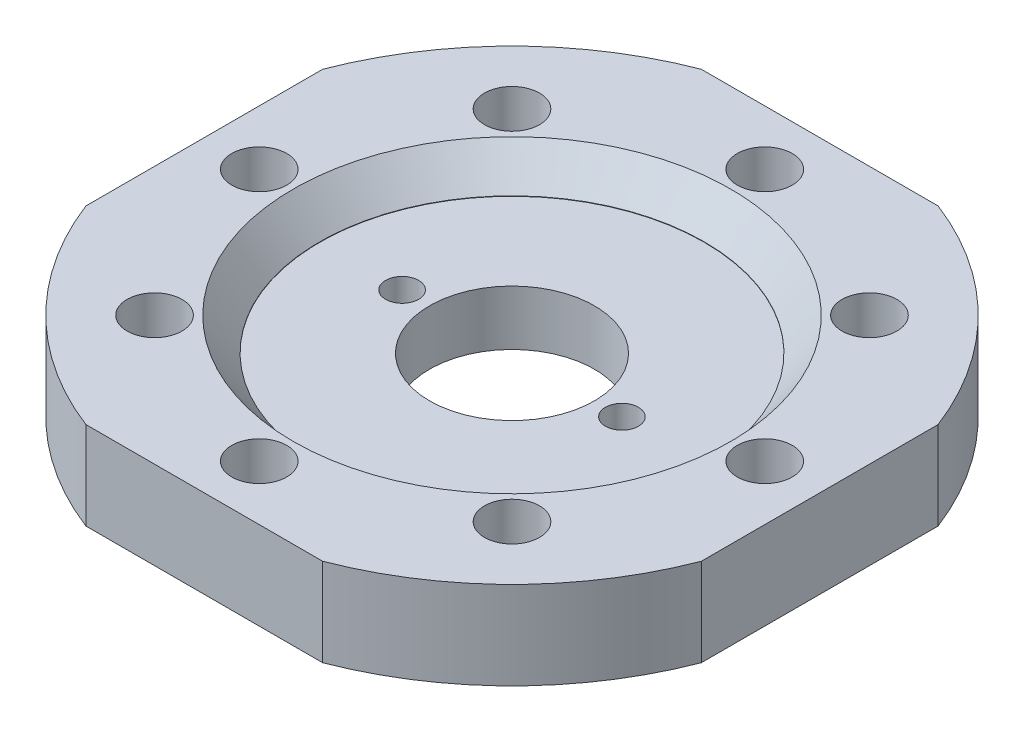
ISO-10303-21;
HEADER;
FILE_DESCRIPTION(('STEP AP214'),'2;1');
FILE_NAME('part.step','',(''),(''),'','','');
FILE_SCHEMA(('AUTOMOTIVE_DESIGN { 1 0 10303 214 1 1 1 1 }'));
ENDSEC;
DATA;
#1=APPLICATION_CONTEXT('core data for automotive mechanical design processes');
#2=APPLICATION_PROTOCOL_DEFINITION('international standard','automotive_design',2000,#1);
#3=PRODUCT_CONTEXT('',#1,'mechanical');
#4=PRODUCT('Part','Part','',(#3));
#5=PRODUCT_RELATED_PRODUCT_CATEGORY('part','',(#4));
#6=PRODUCT_DEFINITION_FORMATION('','',#4);
#7=PRODUCT_DEFINITION_CONTEXT('part definition',#1,'design');
#8=PRODUCT_DEFINITION('design','',#6,#7);
#9=PRODUCT_DEFINITION_SHAPE('','',#8);
#10=(LENGTH_UNIT() NAMED_UNIT(*) SI_UNIT(.MILLI.,.METRE.));
#11=(NAMED_UNIT(*) PLANE_ANGLE_UNIT() SI_UNIT($,.RADIAN.));
#12=(NAMED_UNIT(*) SI_UNIT($,.STERADIAN.) SOLID_ANGLE_UNIT());
#13=UNCERTAINTY_MEASURE_WITH_UNIT(LENGTH_MEASURE(1.E-05),#10,'distance_accuracy_value','');
#14=(GEOMETRIC_REPRESENTATION_CONTEXT(3) GLOBAL_UNCERTAINTY_ASSIGNED_CONTEXT((#13)) GLOBAL_UNIT_ASSIGNED_CONTEXT((#10,
#11,#12)) REPRESENTATION_CONTEXT('',''));
#15=CARTESIAN_POINT('',(0.,0.,0.));
#16=DIRECTION('',(0.,0.,1.));
#17=DIRECTION('',(1.,0.,0.));
#18=AXIS2_PLACEMENT_3D('',#15,#16,#17);
#19=CARTESIAN_POINT('',(0.,40.,0.));
#20=DIRECTION('',(0.,-1.,0.));
#21=DIRECTION('',(0.,0.,-1.));
#22=AXIS2_PLACEMENT_3D('',#19,#20,#21);
#23=CYLINDRICAL_SURFACE('',#22,150.);
#24=CARTESIAN_POINT('',(0.,40.,0.));
#25=DIRECTION('',(0.,1.,0.));
#26=DIRECTION('',(0.,0.,1.));
#27=AXIS2_PLACEMENT_3D('',#24,#25,#26);
#28=CIRCLE('',#27,150.);
#29=CARTESIAN_POINT('',(-53.8516480713449,40.,-140.));
#30=VERTEX_POINT('',#29);
#31=CARTESIAN_POINT('',(-140.,40.,-53.8516480713449));
#32=VERTEX_POINT('',#31);
#33=EDGE_CURVE('E274',#30,#32,#28,.T.);
#34=ORIENTED_EDGE('',*,*,#33,.F.);
#35=DIRECTION('',(0.,-1.,0.));
#36=VECTOR('',#35,1.);
#37=CARTESIAN_POINT('',(-53.8516480713449,40.,-140.));
#38=LINE('',#37,#36);
#39=CARTESIAN_POINT('',(-53.8516480713449,0.,-140.));
#40=VERTEX_POINT('',#39);
#41=EDGE_CURVE('E151',#30,#40,#38,.T.);
#42=ORIENTED_EDGE('',*,*,#41,.T.);
#43=CARTESIAN_POINT('',(0.,0.,0.));
#44=DIRECTION('',(0.,1.,0.));
#45=DIRECTION('',(0.,0.,1.));
#46=AXIS2_PLACEMENT_3D('',#43,#44,#45);
#47=CIRCLE('',#46,150.);
#48=CARTESIAN_POINT('',(-140.,0.,-53.8516480713449));
#49=VERTEX_POINT('',#48);
#50=EDGE_CURVE('E267',#40,#49,#47,.T.);
#51=ORIENTED_EDGE('',*,*,#50,.T.);
#52=DIRECTION('',(0.,-1.,0.));
#53=VECTOR('',#52,1.);
#54=CARTESIAN_POINT('',(-140.,40.,-53.8516480713449));
#55=LINE('',#54,#53);
#56=EDGE_CURVE('E179',#49,#32,#55,.F.);
#57=ORIENTED_EDGE('',*,*,#56,.T.);
#58=EDGE_LOOP('',(#34,#42,#51,#57));
#59=FACE_BOUND('',#58,.T.);
#60=ADVANCED_FACE('F51',(#59),#23,.T.);
#61=DIRECTION('',(0.,-1.,0.));
#62=VECTOR('',#61,1.);
#63=CARTESIAN_POINT('',(140.,40.,53.8516480713449));
#64=LINE('',#63,#62);
#65=CARTESIAN_POINT('',(140.,40.,53.8516480713449));
#66=VERTEX_POINT('',#65);
#67=CARTESIAN_POINT('',(140.,0.,53.8516480713449));
#68=VERTEX_POINT('',#67);
#69=EDGE_CURVE('E162',#66,#68,#64,.T.);
#70=ORIENTED_EDGE('',*,*,#69,.F.);
#71=CARTESIAN_POINT('',(53.8516480713449,40.,140.));
#72=VERTEX_POINT('',#71);
#73=EDGE_CURVE('E273',#72,#66,#28,.T.);
#74=ORIENTED_EDGE('',*,*,#73,.F.);
#75=DIRECTION('',(0.,-1.,0.));
#76=VECTOR('',#75,1.);
#77=CARTESIAN_POINT('',(53.8516480713449,40.,140.));
#78=LINE('',#77,#76);
#79=CARTESIAN_POINT('',(53.8516480713449,0.,140.));
#80=VERTEX_POINT('',#79);
#81=EDGE_CURVE('E168',#80,#72,#78,.F.);
#82=ORIENTED_EDGE('',*,*,#81,.F.);
#83=EDGE_CURVE('E279',#80,#68,#47,.T.);
#84=ORIENTED_EDGE('',*,*,#83,.T.);
#85=EDGE_LOOP('',(#70,#74,#82,#84));
#86=FACE_BOUND('',#85,.T.);
#87=ADVANCED_FACE('F309',(#86),#23,.T.);
#88=CARTESIAN_POINT('',(140.,0.,-53.8516480713449));
#89=VERTEX_POINT('',#88);
#90=CARTESIAN_POINT('',(53.8516480713449,0.,-140.));
#91=VERTEX_POINT('',#90);
#92=EDGE_CURVE('E307',#89,#91,#47,.T.);
#93=ORIENTED_EDGE('',*,*,#92,.T.);
#94=DIRECTION('',(0.,-1.,0.));
#95=VECTOR('',#94,1.);
#96=CARTESIAN_POINT('',(53.8516480713449,40.,-140.));
#97=LINE('',#96,#95);
#98=CARTESIAN_POINT('',(53.8516480713449,40.,-140.));
#99=VERTEX_POINT('',#98);
#100=EDGE_CURVE('E67',#91,#99,#97,.F.);
#101=ORIENTED_EDGE('',*,*,#100,.T.);
#102=CARTESIAN_POINT('',(140.,40.,-53.8516480713449));
#103=VERTEX_POINT('',#102);
#104=EDGE_CURVE('E338',#103,#99,#28,.T.);
#105=ORIENTED_EDGE('',*,*,#104,.F.);
#106=DIRECTION('',(0.,-1.,0.));
#107=VECTOR('',#106,1.);
#108=CARTESIAN_POINT('',(140.,40.,-53.8516480713449));
#109=LINE('',#108,#107);
#110=EDGE_CURVE('E158',#89,#103,#109,.F.);
#111=ORIENTED_EDGE('',*,*,#110,.F.);
#112=EDGE_LOOP('',(#93,#101,#105,#111));
#113=FACE_BOUND('',#112,.T.);
#114=ADVANCED_FACE('F348',(#113),#23,.T.);
#115=CARTESIAN_POINT('',(0.,40.,0.));
#116=DIRECTION('',(0.,1.,0.));
#117=DIRECTION('',(0.,0.,1.));
#118=AXIS2_PLACEMENT_3D('',#115,#116,#117);
#119=PLANE('',#118);
#120=DIRECTION('',(1.,0.,0.));
#121=VECTOR('',#120,1.);
#122=CARTESIAN_POINT('',(0.,40.,-140.));
#123=LINE('',#122,#121);
#124=EDGE_CURVE('E155',#30,#99,#123,.T.);
#125=ORIENTED_EDGE('',*,*,#124,.F.);
#126=ORIENTED_EDGE('',*,*,#33,.T.);
#127=DIRECTION('',(0.,0.,-1.));
#128=VECTOR('',#127,1.);
#129=CARTESIAN_POINT('',(-140.,40.,0.));
#130=LINE('',#129,#128);
#131=CARTESIAN_POINT('',(-140.,40.,53.8516480713449));
#132=VERTEX_POINT('',#131);
#133=EDGE_CURVE('E187',#132,#32,#130,.T.);
#134=ORIENTED_EDGE('',*,*,#133,.F.);
#135=CARTESIAN_POINT('',(-53.8516480713449,40.,140.));
#136=VERTEX_POINT('',#135);
#137=EDGE_CURVE('E268',#132,#136,#28,.T.);
#138=ORIENTED_EDGE('',*,*,#137,.T.);
#139=DIRECTION('',(1.,0.,0.));
#140=VECTOR('',#139,1.);
#141=CARTESIAN_POINT('',(0.,40.,140.));
#142=LINE('',#141,#140);
#143=EDGE_CURVE('E176',#136,#72,#142,.T.);
#144=ORIENTED_EDGE('',*,*,#143,.T.);
#145=ORIENTED_EDGE('',*,*,#73,.T.);
#146=DIRECTION('',(0.,0.,-1.));
#147=VECTOR('',#146,1.);
#148=CARTESIAN_POINT('',(140.,40.,0.));
#149=LINE('',#148,#147);
#150=EDGE_CURVE('E74',#66,#103,#149,.T.);
#151=ORIENTED_EDGE('',*,*,#150,.T.);
#152=ORIENTED_EDGE('',*,*,#104,.T.);
#153=EDGE_LOOP('',(#125,#126,#134,#138,#144,#145,#151,#152));
#154=FACE_BOUND('',#153,.T.);
#155=CARTESIAN_POINT('',(0.,40.,0.));
#156=DIRECTION('',(0.,1.,0.));
#157=DIRECTION('',(0.,0.,1.));
#158=AXIS2_PLACEMENT_3D('',#155,#156,#157);
#159=CIRCLE('',#158,99.5);
#160=CARTESIAN_POINT('',(0.,40.,99.5));
#161=VERTEX_POINT('',#160);
#162=EDGE_CURVE('E283',#161,#161,#159,.F.);
#163=ORIENTED_EDGE('',*,*,#162,.T.);
#164=EDGE_LOOP('',(#163));
#165=FACE_BOUND('',#164,.T.);
#166=CARTESIAN_POINT('',(81.3172798364539,40.,81.317279836452));
#167=DIRECTION('',(0.,1.,0.));
#168=DIRECTION('',(0.,0.,1.));
#169=AXIS2_PLACEMENT_3D('',#166,#167,#168);
#170=CIRCLE('',#169,12.5);
#171=CARTESIAN_POINT('',(81.3172798364539,40.,93.817279836452));
#172=VERTEX_POINT('',#171);
#173=EDGE_CURVE('E191',#172,#172,#170,.T.);
#174=ORIENTED_EDGE('',*,*,#173,.F.);
#175=EDGE_LOOP('',(#174));
#176=FACE_BOUND('',#175,.T.);
#177=CARTESIAN_POINT('',(1.20456106190088E-12,40.,115.));
#178=DIRECTION('',(0.,1.,0.));
#179=DIRECTION('',(0.,0.,1.));
#180=AXIS2_PLACEMENT_3D('',#177,#178,#179);
#181=CIRCLE('',#180,12.5);
#182=CARTESIAN_POINT('',(1.20456106190088E-12,40.,127.5));
#183=VERTEX_POINT('',#182);
#184=EDGE_CURVE('E199',#183,#183,#181,.T.);
#185=ORIENTED_EDGE('',*,*,#184,.F.);
#186=EDGE_LOOP('',(#185));
#187=FACE_BOUND('',#186,.T.);
#188=CARTESIAN_POINT('',(-81.3172798364523,40.,81.3172798364537));
#189=DIRECTION('',(0.,1.,0.));
#190=DIRECTION('',(0.,0.,1.));
#191=AXIS2_PLACEMENT_3D('',#188,#189,#190);
#192=CIRCLE('',#191,12.5);
#193=CARTESIAN_POINT('',(-81.3172798364523,40.,93.8172798364537));
#194=VERTEX_POINT('',#193);
#195=EDGE_CURVE('E207',#194,#194,#192,.T.);
#196=ORIENTED_EDGE('',*,*,#195,.F.);
#197=EDGE_LOOP('',(#196));
#198=FACE_BOUND('',#197,.T.);
#199=CARTESIAN_POINT('',(-115.,40.,0.));
#200=DIRECTION('',(0.,1.,0.));
#201=DIRECTION('',(0.,0.,1.));
#202=AXIS2_PLACEMENT_3D('',#199,#200,#201);
#203=CIRCLE('',#202,12.5);
#204=CARTESIAN_POINT('',(-115.,40.,12.5));
#205=VERTEX_POINT('',#204);
#206=EDGE_CURVE('E215',#205,#205,#203,.T.);
#207=ORIENTED_EDGE('',*,*,#206,.F.);
#208=EDGE_LOOP('',(#207));
#209=FACE_BOUND('',#208,.T.);
#210=CARTESIAN_POINT('',(-81.3172798364534,40.,-81.3172798364525));
#211=DIRECTION('',(0.,1.,0.));
#212=DIRECTION('',(0.,0.,1.));
#213=AXIS2_PLACEMENT_3D('',#210,#211,#212);
#214=CIRCLE('',#213,12.5);
#215=CARTESIAN_POINT('',(-81.3172798364534,40.,-68.8172798364526));
#216=VERTEX_POINT('',#215);
#217=EDGE_CURVE('E223',#216,#216,#214,.T.);
#218=ORIENTED_EDGE('',*,*,#217,.F.);
#219=EDGE_LOOP('',(#218));
#220=FACE_BOUND('',#219,.T.);
#221=CARTESIAN_POINT('',(-4.0152035396696E-13,40.,-115.));
#222=DIRECTION('',(0.,1.,0.));
#223=DIRECTION('',(0.,0.,1.));
#224=AXIS2_PLACEMENT_3D('',#221,#222,#223);
#225=CIRCLE('',#224,12.5);
#226=CARTESIAN_POINT('',(-4.0152035396696E-13,40.,-102.5));
#227=VERTEX_POINT('',#226);
#228=EDGE_CURVE('E231',#227,#227,#225,.T.);
#229=ORIENTED_EDGE('',*,*,#228,.F.);
#230=EDGE_LOOP('',(#229));
#231=FACE_BOUND('',#230,.T.);
#232=CARTESIAN_POINT('',(81.3172798364528,40.,-81.3172798364531));
#233=DIRECTION('',(0.,1.,0.));
#234=DIRECTION('',(0.,0.,1.));
#235=AXIS2_PLACEMENT_3D('',#232,#233,#234);
#236=CIRCLE('',#235,12.5);
#237=CARTESIAN_POINT('',(81.3172798364528,40.,-68.8172798364531));
#238=VERTEX_POINT('',#237);
#239=EDGE_CURVE('E239',#238,#238,#236,.T.);
#240=ORIENTED_EDGE('',*,*,#239,.F.);
#241=EDGE_LOOP('',(#240));
#242=FACE_BOUND('',#241,.T.);
#243=CARTESIAN_POINT('',(115.,40.,0.));
#244=DIRECTION('',(0.,1.,0.));
#245=DIRECTION('',(0.,0.,1.));
#246=AXIS2_PLACEMENT_3D('',#243,#244,#245);
#247=CIRCLE('',#246,12.5);
#248=CARTESIAN_POINT('',(115.,40.,12.5));
#249=VERTEX_POINT('',#248);
#250=EDGE_CURVE('E247',#249,#249,#247,.T.);
#251=ORIENTED_EDGE('',*,*,#250,.F.);
#252=EDGE_LOOP('',(#251));
#253=FACE_BOUND('',#252,.T.);
#254=ADVANCED_FACE('F335',(#154,#165,#176,#187,#198,#209,#220,#231,#242,#253),#119,.T.);
#255=CARTESIAN_POINT('',(0.,0.,0.));
#256=DIRECTION('',(0.,1.,0.));
#257=DIRECTION('',(0.,0.,1.));
#258=AXIS2_PLACEMENT_3D('',#255,#256,#257);
#259=PLANE('',#258);
#260=CARTESIAN_POINT('',(81.3172798364539,0.,81.317279836452));
#261=DIRECTION('',(0.,1.,0.));
#262=DIRECTION('',(0.,0.,1.));
#263=AXIS2_PLACEMENT_3D('',#260,#261,#262);
#264=CIRCLE('',#263,12.5);
#265=CARTESIAN_POINT('',(81.3172798364539,0.,93.817279836452));
#266=VERTEX_POINT('',#265);
#267=EDGE_CURVE('E195',#266,#266,#264,.T.);
#268=ORIENTED_EDGE('',*,*,#267,.T.);
#269=EDGE_LOOP('',(#268));
#270=FACE_BOUND('',#269,.T.);
#271=CARTESIAN_POINT('',(1.20456106190088E-12,0.,115.));
#272=DIRECTION('',(0.,1.,0.));
#273=DIRECTION('',(0.,0.,1.));
#274=AXIS2_PLACEMENT_3D('',#271,#272,#273);
#275=CIRCLE('',#274,12.5);
#276=CARTESIAN_POINT('',(1.20456106190088E-12,0.,127.5));
#277=VERTEX_POINT('',#276);
#278=EDGE_CURVE('E203',#277,#277,#275,.T.);
#279=ORIENTED_EDGE('',*,*,#278,.T.);
#280=EDGE_LOOP('',(#279));
#281=FACE_BOUND('',#280,.T.);
#282=CARTESIAN_POINT('',(-81.3172798364523,0.,81.3172798364537));
#283=DIRECTION('',(0.,1.,0.));
#284=DIRECTION('',(0.,0.,1.));
#285=AXIS2_PLACEMENT_3D('',#282,#283,#284);
#286=CIRCLE('',#285,12.5);
#287=CARTESIAN_POINT('',(-81.3172798364523,0.,93.8172798364537));
#288=VERTEX_POINT('',#287);
#289=EDGE_CURVE('E211',#288,#288,#286,.T.);
#290=ORIENTED_EDGE('',*,*,#289,.T.);
#291=EDGE_LOOP('',(#290));
#292=FACE_BOUND('',#291,.T.);
#293=CARTESIAN_POINT('',(-115.,0.,0.));
#294=DIRECTION('',(0.,1.,0.));
#295=DIRECTION('',(0.,0.,1.));
#296=AXIS2_PLACEMENT_3D('',#293,#294,#295);
#297=CIRCLE('',#296,12.5);
#298=CARTESIAN_POINT('',(-115.,0.,12.5));
#299=VERTEX_POINT('',#298);
#300=EDGE_CURVE('E219',#299,#299,#297,.T.);
#301=ORIENTED_EDGE('',*,*,#300,.T.);
#302=EDGE_LOOP('',(#301));
#303=FACE_BOUND('',#302,.T.);
#304=CARTESIAN_POINT('',(-81.3172798364534,0.,-81.3172798364525));
#305=DIRECTION('',(0.,1.,0.));
#306=DIRECTION('',(0.,0.,1.));
#307=AXIS2_PLACEMENT_3D('',#304,#305,#306);
#308=CIRCLE('',#307,12.5);
#309=CARTESIAN_POINT('',(-81.3172798364534,0.,-68.8172798364526));
#310=VERTEX_POINT('',#309);
#311=EDGE_CURVE('E227',#310,#310,#308,.T.);
#312=ORIENTED_EDGE('',*,*,#311,.T.);
#313=EDGE_LOOP('',(#312));
#314=FACE_BOUND('',#313,.T.);
#315=CARTESIAN_POINT('',(-4.0152035396696E-13,0.,-115.));
#316=DIRECTION('',(0.,1.,0.));
#317=DIRECTION('',(0.,0.,1.));
#318=AXIS2_PLACEMENT_3D('',#315,#316,#317);
#319=CIRCLE('',#318,12.5);
#320=CARTESIAN_POINT('',(-4.0152035396696E-13,0.,-102.5));
#321=VERTEX_POINT('',#320);
#322=EDGE_CURVE('E235',#321,#321,#319,.T.);
#323=ORIENTED_EDGE('',*,*,#322,.T.);
#324=EDGE_LOOP('',(#323));
#325=FACE_BOUND('',#324,.T.);
#326=CARTESIAN_POINT('',(81.3172798364528,0.,-81.3172798364531));
#327=DIRECTION('',(0.,1.,0.));
#328=DIRECTION('',(0.,0.,1.));
#329=AXIS2_PLACEMENT_3D('',#326,#327,#328);
#330=CIRCLE('',#329,12.5);
#331=CARTESIAN_POINT('',(81.3172798364528,0.,-68.8172798364531));
#332=VERTEX_POINT('',#331);
#333=EDGE_CURVE('E243',#332,#332,#330,.T.);
#334=ORIENTED_EDGE('',*,*,#333,.T.);
#335=EDGE_LOOP('',(#334));
#336=FACE_BOUND('',#335,.T.);
#337=CARTESIAN_POINT('',(115.,0.,0.));
#338=DIRECTION('',(0.,1.,0.));
#339=DIRECTION('',(0.,0.,1.));
#340=AXIS2_PLACEMENT_3D('',#337,#338,#339);
#341=CIRCLE('',#340,12.5);
#342=CARTESIAN_POINT('',(115.,0.,12.5));
#343=VERTEX_POINT('',#342);
#344=EDGE_CURVE('E251',#343,#343,#341,.T.);
#345=ORIENTED_EDGE('',*,*,#344,.T.);
#346=EDGE_LOOP('',(#345));
#347=FACE_BOUND('',#346,.T.);
#348=CARTESIAN_POINT('',(0.,0.,0.));
#349=DIRECTION('',(0.,1.,0.));
#350=DIRECTION('',(0.,0.,1.));
#351=AXIS2_PLACEMENT_3D('',#348,#349,#350);
#352=CIRCLE('',#351,37.5);
#353=CARTESIAN_POINT('',(0.,0.,37.5));
#354=VERTEX_POINT('',#353);
#355=EDGE_CURVE('E263',#354,#354,#352,.T.);
#356=ORIENTED_EDGE('',*,*,#355,.T.);
#357=EDGE_LOOP('',(#356));
#358=FACE_BOUND('',#357,.T.);
#359=ORIENTED_EDGE('',*,*,#50,.F.);
#360=DIRECTION('',(1.,0.,0.));
#361=VECTOR('',#360,1.);
#362=CARTESIAN_POINT('',(0.,0.,-140.));
#363=LINE('',#362,#361);
#364=EDGE_CURVE('E12',#40,#91,#363,.T.);
#365=ORIENTED_EDGE('',*,*,#364,.T.);
#366=ORIENTED_EDGE('',*,*,#92,.F.);
#367=DIRECTION('',(0.,0.,-1.));
#368=VECTOR('',#367,1.);
#369=CARTESIAN_POINT('',(140.,0.,0.));
#370=LINE('',#369,#368);
#371=EDGE_CURVE('E60',#68,#89,#370,.T.);
#372=ORIENTED_EDGE('',*,*,#371,.F.);
#373=ORIENTED_EDGE('',*,*,#83,.F.);
#374=DIRECTION('',(1.,0.,0.));
#375=VECTOR('',#374,1.);
#376=CARTESIAN_POINT('',(0.,0.,140.));
#377=LINE('',#376,#375);
#378=CARTESIAN_POINT('',(-53.8516480713449,0.,140.));
#379=VERTEX_POINT('',#378);
#380=EDGE_CURVE('E291',#379,#80,#377,.T.);
#381=ORIENTED_EDGE('',*,*,#380,.F.);
#382=CARTESIAN_POINT('',(-140.,0.,53.8516480713449));
#383=VERTEX_POINT('',#382);
#384=EDGE_CURVE('E275',#383,#379,#47,.T.);
#385=ORIENTED_EDGE('',*,*,#384,.F.);
#386=DIRECTION('',(0.,0.,-1.));
#387=VECTOR('',#386,1.);
#388=CARTESIAN_POINT('',(-140.,0.,0.));
#389=LINE('',#388,#387);
#390=EDGE_CURVE('E287',#383,#49,#389,.T.);
#391=ORIENTED_EDGE('',*,*,#390,.T.);
#392=EDGE_LOOP('',(#359,#365,#366,#372,#373,#381,#385,#391));
#393=FACE_BOUND('',#392,.T.);
#394=ADVANCED_FACE('F304',(#270,#281,#292,#303,#314,#325,#336,#347,#358,#393),#259,.F.);
#395=DIRECTION('',(0.,-1.,0.));
#396=VECTOR('',#395,1.);
#397=CARTESIAN_POINT('',(-53.8516480713449,40.,140.));
#398=LINE('',#397,#396);
#399=EDGE_CURVE('E172',#136,#379,#398,.T.);
#400=ORIENTED_EDGE('',*,*,#399,.F.);
#401=ORIENTED_EDGE('',*,*,#137,.F.);
#402=DIRECTION('',(0.,-1.,0.));
#403=VECTOR('',#402,1.);
#404=CARTESIAN_POINT('',(-140.,40.,53.8516480713449));
#405=LINE('',#404,#403);
#406=EDGE_CURVE('E183',#132,#383,#405,.T.);
#407=ORIENTED_EDGE('',*,*,#406,.T.);
#408=ORIENTED_EDGE('',*,*,#384,.T.);
#409=EDGE_LOOP('',(#400,#401,#407,#408));
#410=FACE_BOUND('',#409,.T.);
#411=ADVANCED_FACE('F329',(#410),#23,.T.);
#412=CARTESIAN_POINT('',(0.,40.,0.));
#413=DIRECTION('',(0.,1.,0.));
#414=DIRECTION('',(0.,0.,1.));
#415=AXIS2_PLACEMENT_3D('',#412,#413,#414);
#416=CYLINDRICAL_SURFACE('',#415,37.5);
#417=ORIENTED_EDGE('',*,*,#355,.F.);
#418=EDGE_LOOP('',(#417));
#419=FACE_BOUND('',#418,.T.);
#420=CARTESIAN_POINT('',(0.,25.,0.));
#421=DIRECTION('',(0.,1.,0.));
#422=DIRECTION('',(0.,0.,1.));
#423=AXIS2_PLACEMENT_3D('',#420,#421,#422);
#424=CIRCLE('',#423,37.5);
#425=CARTESIAN_POINT('',(0.,25.,37.5));
#426=VERTEX_POINT('',#425);
#427=EDGE_CURVE('E259',#426,#426,#424,.T.);
#428=ORIENTED_EDGE('',*,*,#427,.T.);
#429=EDGE_LOOP('',(#428));
#430=FACE_BOUND('',#429,.T.);
#431=ADVANCED_FACE('F357',(#419,#430),#416,.F.);
#432=CARTESIAN_POINT('',(37.5,25.,0.));
#433=DIRECTION('',(0.,-1.,0.));
#434=DIRECTION('',(0.,0.,-1.));
#435=AXIS2_PLACEMENT_3D('',#432,#433,#434);
#436=PLANE('',#435);
#437=CARTESIAN_POINT('',(-50.,25.,0.));
#438=DIRECTION('',(0.,1.,0.));
#439=DIRECTION('',(0.,0.,1.));
#440=AXIS2_PLACEMENT_3D('',#437,#438,#439);
#441=CIRCLE('',#440,7.49999999999999);
#442=CARTESIAN_POINT('',(-50.,25.,7.49999999999999));
#443=VERTEX_POINT('',#442);
#444=EDGE_CURVE('E134',#443,#443,#441,.T.);
#445=ORIENTED_EDGE('',*,*,#444,.F.);
#446=EDGE_LOOP('',(#445));
#447=FACE_BOUND('',#446,.T.);
#448=CARTESIAN_POINT('',(50.,25.,0.));
#449=DIRECTION('',(0.,1.,0.));
#450=DIRECTION('',(0.,0.,1.));
#451=AXIS2_PLACEMENT_3D('',#448,#449,#450);
#452=CIRCLE('',#451,7.49999999999999);
#453=CARTESIAN_POINT('',(50.,25.,7.49999999999999));
#454=VERTEX_POINT('',#453);
#455=EDGE_CURVE('E133',#454,#454,#452,.T.);
#456=ORIENTED_EDGE('',*,*,#455,.F.);
#457=EDGE_LOOP('',(#456));
#458=FACE_BOUND('',#457,.T.);
#459=ORIENTED_EDGE('',*,*,#427,.F.);
#460=EDGE_LOOP('',(#459));
#461=FACE_BOUND('',#460,.T.);
#462=CARTESIAN_POINT('',(0.,25.,0.));
#463=DIRECTION('',(0.,1.,0.));
#464=DIRECTION('',(0.,0.,1.));
#465=AXIS2_PLACEMENT_3D('',#462,#463,#464);
#466=CIRCLE('',#465,87.5);
#467=CARTESIAN_POINT('',(0.,25.,87.5));
#468=VERTEX_POINT('',#467);
#469=EDGE_CURVE('E255',#468,#468,#466,.T.);
#470=ORIENTED_EDGE('',*,*,#469,.T.);
#471=EDGE_LOOP('',(#470));
#472=FACE_BOUND('',#471,.T.);
#473=ADVANCED_FACE('F469',(#447,#458,#461,#472),#436,.F.);
#474=CARTESIAN_POINT('',(0.,40.,0.));
#475=DIRECTION('',(0.,1.,0.));
#476=DIRECTION('',(0.,0.,1.));
#477=AXIS2_PLACEMENT_3D('',#474,#475,#476);
#478=CYLINDRICAL_SURFACE('',#477,87.5);
#479=CARTESIAN_POINT('',(0.,25.1812341215795,0.));
#480=DIRECTION('',(0.,1.,0.));
#481=DIRECTION('',(0.,0.,1.));
#482=AXIS2_PLACEMENT_3D('',#479,#480,#481);
#483=CIRCLE('',#482,87.5);
#484=CARTESIAN_POINT('',(0.,25.1812341215795,87.5));
#485=VERTEX_POINT('',#484);
#486=EDGE_CURVE('E272',#485,#485,#483,.T.);
#487=ORIENTED_EDGE('',*,*,#486,.T.);
#488=EDGE_LOOP('',(#487));
#489=FACE_BOUND('',#488,.T.);
#490=ORIENTED_EDGE('',*,*,#469,.F.);
#491=EDGE_LOOP('',(#490));
#492=FACE_BOUND('',#491,.T.);
#493=ADVANCED_FACE('F465',(#489,#492),#478,.F.);
#494=CARTESIAN_POINT('',(115.,40.,0.));
#495=DIRECTION('',(0.,1.,0.));
#496=DIRECTION('',(0.,0.,1.));
#497=AXIS2_PLACEMENT_3D('',#494,#495,#496);
#498=CYLINDRICAL_SURFACE('',#497,12.5);
#499=ORIENTED_EDGE('',*,*,#344,.F.);
#500=EDGE_LOOP('',(#499));
#501=FACE_BOUND('',#500,.T.);
#502=ORIENTED_EDGE('',*,*,#250,.T.);
#503=EDGE_LOOP('',(#502));
#504=FACE_BOUND('',#503,.T.);
#505=ADVANCED_FACE('F461',(#501,#504),#498,.F.);
#506=CARTESIAN_POINT('',(81.3172798364528,40.,-81.3172798364531));
#507=DIRECTION('',(0.,1.,0.));
#508=DIRECTION('',(0.,0.,1.));
#509=AXIS2_PLACEMENT_3D('',#506,#507,#508);
#510=CYLINDRICAL_SURFACE('',#509,12.5);
#511=ORIENTED_EDGE('',*,*,#333,.F.);
#512=EDGE_LOOP('',(#511));
#513=FACE_BOUND('',#512,.T.);
#514=ORIENTED_EDGE('',*,*,#239,.T.);
#515=EDGE_LOOP('',(#514));
#516=FACE_BOUND('',#515,.T.);
#517=ADVANCED_FACE('F457',(#513,#516),#510,.F.);
#518=CARTESIAN_POINT('',(-4.0152035396696E-13,40.,-115.));
#519=DIRECTION('',(0.,1.,0.));
#520=DIRECTION('',(0.,0.,1.));
#521=AXIS2_PLACEMENT_3D('',#518,#519,#520);
#522=CYLINDRICAL_SURFACE('',#521,12.5);
#523=ORIENTED_EDGE('',*,*,#322,.F.);
#524=EDGE_LOOP('',(#523));
#525=FACE_BOUND('',#524,.T.);
#526=ORIENTED_EDGE('',*,*,#228,.T.);
#527=EDGE_LOOP('',(#526));
#528=FACE_BOUND('',#527,.T.);
#529=ADVANCED_FACE('F453',(#525,#528),#522,.F.);
#530=CARTESIAN_POINT('',(-81.3172798364534,40.,-81.3172798364525));
#531=DIRECTION('',(0.,1.,0.));
#532=DIRECTION('',(0.,0.,1.));
#533=AXIS2_PLACEMENT_3D('',#530,#531,#532);
#534=CYLINDRICAL_SURFACE('',#533,12.5);
#535=ORIENTED_EDGE('',*,*,#311,.F.);
#536=EDGE_LOOP('',(#535));
#537=FACE_BOUND('',#536,.T.);
#538=ORIENTED_EDGE('',*,*,#217,.T.);
#539=EDGE_LOOP('',(#538));
#540=FACE_BOUND('',#539,.T.);
#541=ADVANCED_FACE('F449',(#537,#540),#534,.F.);
#542=CARTESIAN_POINT('',(-115.,40.,0.));
#543=DIRECTION('',(0.,1.,0.));
#544=DIRECTION('',(0.,0.,1.));
#545=AXIS2_PLACEMENT_3D('',#542,#543,#544);
#546=CYLINDRICAL_SURFACE('',#545,12.5);
#547=ORIENTED_EDGE('',*,*,#300,.F.);
#548=EDGE_LOOP('',(#547));
#549=FACE_BOUND('',#548,.T.);
#550=ORIENTED_EDGE('',*,*,#206,.T.);
#551=EDGE_LOOP('',(#550));
#552=FACE_BOUND('',#551,.T.);
#553=ADVANCED_FACE('F445',(#549,#552),#546,.F.);
#554=CARTESIAN_POINT('',(-81.3172798364523,40.,81.3172798364537));
#555=DIRECTION('',(0.,1.,0.));
#556=DIRECTION('',(0.,0.,1.));
#557=AXIS2_PLACEMENT_3D('',#554,#555,#556);
#558=CYLINDRICAL_SURFACE('',#557,12.5);
#559=ORIENTED_EDGE('',*,*,#289,.F.);
#560=EDGE_LOOP('',(#559));
#561=FACE_BOUND('',#560,.T.);
#562=ORIENTED_EDGE('',*,*,#195,.T.);
#563=EDGE_LOOP('',(#562));
#564=FACE_BOUND('',#563,.T.);
#565=ADVANCED_FACE('F441',(#561,#564),#558,.F.);
#566=CARTESIAN_POINT('',(1.20456106190088E-12,40.,115.));
#567=DIRECTION('',(0.,1.,0.));
#568=DIRECTION('',(0.,0.,1.));
#569=AXIS2_PLACEMENT_3D('',#566,#567,#568);
#570=CYLINDRICAL_SURFACE('',#569,12.5);
#571=ORIENTED_EDGE('',*,*,#278,.F.);
#572=EDGE_LOOP('',(#571));
#573=FACE_BOUND('',#572,.T.);
#574=ORIENTED_EDGE('',*,*,#184,.T.);
#575=EDGE_LOOP('',(#574));
#576=FACE_BOUND('',#575,.T.);
#577=ADVANCED_FACE('F437',(#573,#576),#570,.F.);
#578=CARTESIAN_POINT('',(81.3172798364539,40.,81.317279836452));
#579=DIRECTION('',(0.,1.,0.));
#580=DIRECTION('',(0.,0.,1.));
#581=AXIS2_PLACEMENT_3D('',#578,#579,#580);
#582=CYLINDRICAL_SURFACE('',#581,12.5);
#583=ORIENTED_EDGE('',*,*,#267,.F.);
#584=EDGE_LOOP('',(#583));
#585=FACE_BOUND('',#584,.T.);
#586=ORIENTED_EDGE('',*,*,#173,.T.);
#587=EDGE_LOOP('',(#586));
#588=FACE_BOUND('',#587,.T.);
#589=ADVANCED_FACE('F434',(#585,#588),#582,.F.);
#590=CARTESIAN_POINT('',(0.,25.1812341215795,0.));
#591=DIRECTION('',(0.,1.,0.));
#592=DIRECTION('',(0.,0.,1.));
#593=AXIS2_PLACEMENT_3D('',#590,#591,#592);
#594=CONICAL_SURFACE('',#593,87.5,0.680678408277791);
#595=ORIENTED_EDGE('',*,*,#162,.F.);
#596=EDGE_LOOP('',(#595));
#597=FACE_BOUND('',#596,.T.);
#598=ORIENTED_EDGE('',*,*,#486,.F.);
#599=EDGE_LOOP('',(#598));
#600=FACE_BOUND('',#599,.T.);
#601=ADVANCED_FACE('F53',(#597,#600),#594,.F.);
#602=CARTESIAN_POINT('',(-140.,0.,0.));
#603=DIRECTION('',(1.,0.,0.));
#604=DIRECTION('',(0.,0.,-1.));
#605=AXIS2_PLACEMENT_3D('',#602,#603,#604);
#606=PLANE('',#605);
#607=ORIENTED_EDGE('',*,*,#406,.F.);
#608=ORIENTED_EDGE('',*,*,#133,.T.);
#609=ORIENTED_EDGE('',*,*,#56,.F.);
#610=ORIENTED_EDGE('',*,*,#390,.F.);
#611=EDGE_LOOP('',(#607,#608,#609,#610));
#612=FACE_BOUND('',#611,.T.);
#613=ADVANCED_FACE('F325',(#612),#606,.F.);
#614=CARTESIAN_POINT('',(0.,0.,140.));
#615=DIRECTION('',(0.,0.,1.));
#616=DIRECTION('',(1.,0.,0.));
#617=AXIS2_PLACEMENT_3D('',#614,#615,#616);
#618=PLANE('',#617);
#619=ORIENTED_EDGE('',*,*,#143,.F.);
#620=ORIENTED_EDGE('',*,*,#399,.T.);
#621=ORIENTED_EDGE('',*,*,#380,.T.);
#622=ORIENTED_EDGE('',*,*,#81,.T.);
#623=EDGE_LOOP('',(#619,#620,#621,#622));
#624=FACE_BOUND('',#623,.T.);
#625=ADVANCED_FACE('F333',(#624),#618,.T.);
#626=CARTESIAN_POINT('',(140.,0.,0.));
#627=DIRECTION('',(1.,0.,0.));
#628=DIRECTION('',(0.,0.,-1.));
#629=AXIS2_PLACEMENT_3D('',#626,#627,#628);
#630=PLANE('',#629);
#631=ORIENTED_EDGE('',*,*,#150,.F.);
#632=ORIENTED_EDGE('',*,*,#69,.T.);
#633=ORIENTED_EDGE('',*,*,#371,.T.);
#634=ORIENTED_EDGE('',*,*,#110,.T.);
#635=EDGE_LOOP('',(#631,#632,#633,#634));
#636=FACE_BOUND('',#635,.T.);
#637=ADVANCED_FACE('F299',(#636),#630,.T.);
#638=CARTESIAN_POINT('',(0.,0.,-140.));
#639=DIRECTION('',(0.,0.,1.));
#640=DIRECTION('',(1.,0.,0.));
#641=AXIS2_PLACEMENT_3D('',#638,#639,#640);
#642=PLANE('',#641);
#643=ORIENTED_EDGE('',*,*,#41,.F.);
#644=ORIENTED_EDGE('',*,*,#124,.T.);
#645=ORIENTED_EDGE('',*,*,#100,.F.);
#646=ORIENTED_EDGE('',*,*,#364,.F.);
#647=EDGE_LOOP('',(#643,#644,#645,#646));
#648=FACE_BOUND('',#647,.T.);
#649=ADVANCED_FACE('F347',(#648),#642,.F.);
#650=CARTESIAN_POINT('',(50.,10.,0.));
#651=DIRECTION('',(0.,1.,0.));
#652=DIRECTION('',(0.,0.,1.));
#653=AXIS2_PLACEMENT_3D('',#650,#651,#652);
#654=CONICAL_SURFACE('',#653,7.49999999999999,1.02974425867665);
#655=CARTESIAN_POINT('',(50.,5.49354535729331,0.));
#656=VERTEX_POINT('',#655);
#657=VERTEX_LOOP('',#656);
#658=FACE_BOUND('',#657,.T.);
#659=CARTESIAN_POINT('',(50.,10.,0.));
#660=DIRECTION('',(0.,1.,0.));
#661=DIRECTION('',(0.,0.,1.));
#662=AXIS2_PLACEMENT_3D('',#659,#660,#661);
#663=CIRCLE('',#662,7.49999999999999);
#664=CARTESIAN_POINT('',(50.,10.,7.49999999999999));
#665=VERTEX_POINT('',#664);
#666=EDGE_CURVE('E141',#665,#665,#663,.T.);
#667=ORIENTED_EDGE('',*,*,#666,.T.);
#668=EDGE_LOOP('',(#667));
#669=FACE_BOUND('',#668,.T.);
#670=ADVANCED_FACE('F389',(#658,#669),#654,.F.);
#671=CARTESIAN_POINT('',(50.,25.,0.));
#672=DIRECTION('',(0.,1.,0.));
#673=DIRECTION('',(0.,0.,1.));
#674=AXIS2_PLACEMENT_3D('',#671,#672,#673);
#675=CYLINDRICAL_SURFACE('',#674,7.49999999999999);
#676=ORIENTED_EDGE('',*,*,#666,.F.);
#677=EDGE_LOOP('',(#676));
#678=FACE_BOUND('',#677,.T.);
#679=ORIENTED_EDGE('',*,*,#455,.T.);
#680=EDGE_LOOP('',(#679));
#681=FACE_BOUND('',#680,.T.);
#682=ADVANCED_FACE('F126',(#678,#681),#675,.F.);
#683=CARTESIAN_POINT('',(-50.,10.,0.));
#684=DIRECTION('',(0.,1.,0.));
#685=DIRECTION('',(0.,0.,1.));
#686=AXIS2_PLACEMENT_3D('',#683,#684,#685);
#687=CONICAL_SURFACE('',#686,7.49999999999999,1.02974425867665);
#688=CARTESIAN_POINT('',(-50.,5.49354535729331,0.));
#689=VERTEX_POINT('',#688);
#690=VERTEX_LOOP('',#689);
#691=FACE_BOUND('',#690,.T.);
#692=CARTESIAN_POINT('',(-50.,10.,0.));
#693=DIRECTION('',(0.,1.,0.));
#694=DIRECTION('',(0.,0.,1.));
#695=AXIS2_PLACEMENT_3D('',#692,#693,#694);
#696=CIRCLE('',#695,7.49999999999999);
#697=CARTESIAN_POINT('',(-50.,10.,7.49999999999999));
#698=VERTEX_POINT('',#697);
#699=EDGE_CURVE('E130',#698,#698,#696,.T.);
#700=ORIENTED_EDGE('',*,*,#699,.T.);
#701=EDGE_LOOP('',(#700));
#702=FACE_BOUND('',#701,.T.);
#703=ADVANCED_FACE('F122',(#691,#702),#687,.F.);
#704=CARTESIAN_POINT('',(-50.,25.,0.));
#705=DIRECTION('',(0.,1.,0.));
#706=DIRECTION('',(0.,0.,1.));
#707=AXIS2_PLACEMENT_3D('',#704,#705,#706);
#708=CYLINDRICAL_SURFACE('',#707,7.49999999999999);
#709=ORIENTED_EDGE('',*,*,#699,.F.);
#710=EDGE_LOOP('',(#709));
#711=FACE_BOUND('',#710,.T.);
#712=ORIENTED_EDGE('',*,*,#444,.T.);
#713=EDGE_LOOP('',(#712));
#714=FACE_BOUND('',#713,.T.);
#715=ADVANCED_FACE('F125',(#711,#714),#708,.F.);
#716=CLOSED_SHELL('',(#60,#87,#114,#254,#394,#411,#431,#473,#493,#505,#517,#529,#541,#553,#565,
#577,#589,#601,#613,#625,#637,#649,#670,#682,#703,#715));
#717=MANIFOLD_SOLID_BREP('B2',#716);
#718=ADVANCED_BREP_SHAPE_REPRESENTATION('',(#18,#717),#14);
#719=SHAPE_DEFINITION_REPRESENTATION(#9,#718);
ENDSEC;
END-ISO-10303-21;
